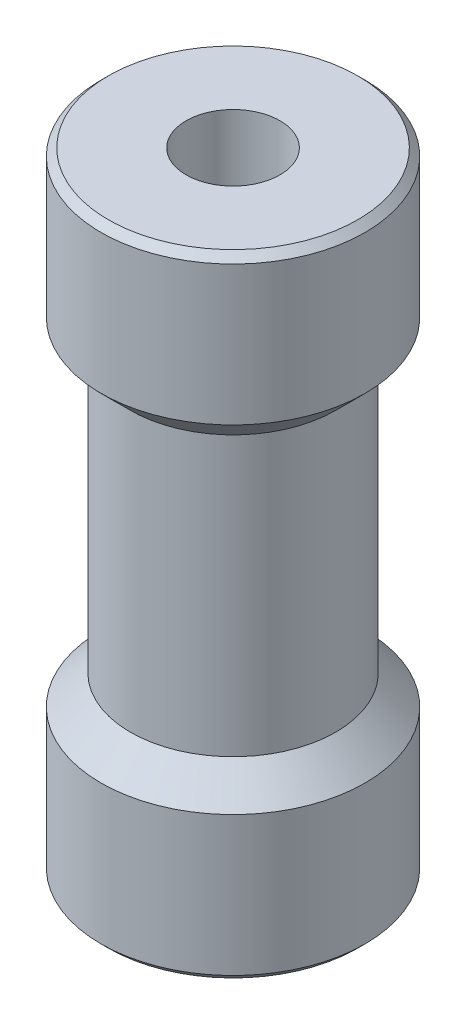
ISO-10303-21;
HEADER;
FILE_DESCRIPTION(('STEP AP214'),'2;1');
FILE_NAME('part.step','',(''),(''),'','','');
FILE_SCHEMA(('AUTOMOTIVE_DESIGN { 1 0 10303 214 1 1 1 1 }'));
ENDSEC;
DATA;
#1=APPLICATION_CONTEXT('core data for automotive mechanical design processes');
#2=APPLICATION_PROTOCOL_DEFINITION('international standard','automotive_design',2000,#1);
#3=PRODUCT_CONTEXT('',#1,'mechanical');
#4=PRODUCT('Part','Part','',(#3));
#5=PRODUCT_RELATED_PRODUCT_CATEGORY('part','',(#4));
#6=PRODUCT_DEFINITION_FORMATION('','',#4);
#7=PRODUCT_DEFINITION_CONTEXT('part definition',#1,'design');
#8=PRODUCT_DEFINITION('design','',#6,#7);
#9=PRODUCT_DEFINITION_SHAPE('','',#8);
#10=(LENGTH_UNIT() NAMED_UNIT(*) SI_UNIT(.MILLI.,.METRE.));
#11=(NAMED_UNIT(*) PLANE_ANGLE_UNIT() SI_UNIT($,.RADIAN.));
#12=(NAMED_UNIT(*) SI_UNIT($,.STERADIAN.) SOLID_ANGLE_UNIT());
#13=UNCERTAINTY_MEASURE_WITH_UNIT(LENGTH_MEASURE(1.E-05),#10,'distance_accuracy_value','');
#14=(GEOMETRIC_REPRESENTATION_CONTEXT(3) GLOBAL_UNCERTAINTY_ASSIGNED_CONTEXT((#13)) GLOBAL_UNIT_ASSIGNED_CONTEXT((#10,
#11,#12)) REPRESENTATION_CONTEXT('',''));
#15=CARTESIAN_POINT('',(0.,0.,0.));
#16=DIRECTION('',(0.,0.,1.));
#17=DIRECTION('',(1.,0.,0.));
#18=AXIS2_PLACEMENT_3D('',#15,#16,#17);
#19=CARTESIAN_POINT('',(0.,0.,0.));
#20=DIRECTION('',(0.,1.,0.));
#21=DIRECTION('',(0.,0.,1.));
#22=AXIS2_PLACEMENT_3D('',#19,#20,#21);
#23=CYLINDRICAL_SURFACE('',#22,3.5);
#24=CARTESIAN_POINT('',(0.,5.99999999997181,0.));
#25=DIRECTION('',(0.,-1.,0.));
#26=DIRECTION('',(1.,0.,0.));
#27=AXIS2_PLACEMENT_3D('',#24,#25,#26);
#28=CIRCLE('',#27,3.49999999991724);
#29=CARTESIAN_POINT('',(3.49999999991724,5.99999999997181,0.));
#30=VERTEX_POINT('',#29);
#31=EDGE_CURVE('E29',#30,#30,#28,.T.);
#32=ORIENTED_EDGE('',*,*,#31,.F.);
#33=EDGE_LOOP('',(#32));
#34=FACE_BOUND('',#33,.T.);
#35=CARTESIAN_POINT('',(0.,15.4999999999745,0.));
#36=DIRECTION('',(0.,1.,0.));
#37=DIRECTION('',(1.,0.,0.));
#38=AXIS2_PLACEMENT_3D('',#35,#36,#37);
#39=CIRCLE('',#38,3.49999999991724);
#40=CARTESIAN_POINT('',(3.49999999991724,15.4999999999745,0.));
#41=VERTEX_POINT('',#40);
#42=EDGE_CURVE('E50',#41,#41,#39,.T.);
#43=ORIENTED_EDGE('',*,*,#42,.F.);
#44=EDGE_LOOP('',(#43));
#45=FACE_BOUND('',#44,.T.);
#46=ADVANCED_FACE('F14',(#34,#45),#23,.T.);
#47=CARTESIAN_POINT('',(0.,4.99999999999545,0.));
#48=DIRECTION('',(0.,-1.,0.));
#49=DIRECTION('',(0.,0.,-1.));
#50=AXIS2_PLACEMENT_3D('',#47,#48,#49);
#51=CONICAL_SURFACE('',#50,4.49999999995043,0.78539816342587);
#52=CARTESIAN_POINT('',(0.,5.,0.));
#53=DIRECTION('',(0.,1.,0.));
#54=DIRECTION('',(0.,0.,1.));
#55=AXIS2_PLACEMENT_3D('',#52,#53,#54);
#56=CIRCLE('',#55,4.5);
#57=CARTESIAN_POINT('',(0.,5.,4.5));
#58=VERTEX_POINT('',#57);
#59=EDGE_CURVE('E48',#58,#58,#56,.F.);
#60=ORIENTED_EDGE('',*,*,#59,.F.);
#61=EDGE_LOOP('',(#60));
#62=FACE_BOUND('',#61,.T.);
#63=ORIENTED_EDGE('',*,*,#31,.T.);
#64=EDGE_LOOP('',(#63));
#65=FACE_BOUND('',#64,.T.);
#66=ADVANCED_FACE('F57',(#62,#65),#51,.T.);
#67=CARTESIAN_POINT('',(0.,16.5000000000646,0.));
#68=DIRECTION('',(0.,1.,0.));
#69=DIRECTION('',(0.,0.,1.));
#70=AXIS2_PLACEMENT_3D('',#67,#68,#69);
#71=CONICAL_SURFACE('',#70,4.50000000000728,0.785398163397448);
#72=CARTESIAN_POINT('',(0.,16.5,0.));
#73=DIRECTION('',(0.,-1.,0.));
#74=DIRECTION('',(0.,0.,-1.));
#75=AXIS2_PLACEMENT_3D('',#72,#73,#74);
#76=CIRCLE('',#75,4.5);
#77=CARTESIAN_POINT('',(0.,16.5,-4.5));
#78=VERTEX_POINT('',#77);
#79=EDGE_CURVE('E44',#78,#78,#76,.F.);
#80=ORIENTED_EDGE('',*,*,#79,.F.);
#81=EDGE_LOOP('',(#80));
#82=FACE_BOUND('',#81,.T.);
#83=ORIENTED_EDGE('',*,*,#42,.T.);
#84=EDGE_LOOP('',(#83));
#85=FACE_BOUND('',#84,.T.);
#86=ADVANCED_FACE('F65',(#82,#85),#71,.T.);
#87=CARTESIAN_POINT('',(0.,0.,0.));
#88=DIRECTION('',(0.,1.,0.));
#89=DIRECTION('',(0.,0.,1.));
#90=AXIS2_PLACEMENT_3D('',#87,#88,#89);
#91=CYLINDRICAL_SURFACE('',#90,4.5);
#92=CARTESIAN_POINT('',(0.,0.250000000050932,0.));
#93=DIRECTION('',(0.,1.,0.));
#94=DIRECTION('',(1.,0.,0.));
#95=AXIS2_PLACEMENT_3D('',#92,#93,#94);
#96=CIRCLE('',#95,4.50000000000728);
#97=CARTESIAN_POINT('',(4.50000000000728,0.250000000050932,0.));
#98=VERTEX_POINT('',#97);
#99=EDGE_CURVE('E39',#98,#98,#96,.F.);
#100=ORIENTED_EDGE('',*,*,#99,.F.);
#101=EDGE_LOOP('',(#100));
#102=FACE_BOUND('',#101,.T.);
#103=ORIENTED_EDGE('',*,*,#59,.T.);
#104=EDGE_LOOP('',(#103));
#105=FACE_BOUND('',#104,.T.);
#106=ADVANCED_FACE('F92',(#102,#105),#91,.T.);
#107=CARTESIAN_POINT('',(0.,21.5,0.));
#108=DIRECTION('',(0.,-1.,0.));
#109=DIRECTION('',(0.,0.,-1.));
#110=AXIS2_PLACEMENT_3D('',#107,#108,#109);
#111=CYLINDRICAL_SURFACE('',#110,4.5);
#112=CARTESIAN_POINT('',(0.,21.2500000000091,0.));
#113=DIRECTION('',(0.,-1.,0.));
#114=DIRECTION('',(1.,0.,0.));
#115=AXIS2_PLACEMENT_3D('',#112,#113,#114);
#116=CIRCLE('',#115,4.49999999995043);
#117=CARTESIAN_POINT('',(4.49999999995043,21.2500000000091,0.));
#118=VERTEX_POINT('',#117);
#119=EDGE_CURVE('E35',#118,#118,#116,.F.);
#120=ORIENTED_EDGE('',*,*,#119,.F.);
#121=EDGE_LOOP('',(#120));
#122=FACE_BOUND('',#121,.T.);
#123=ORIENTED_EDGE('',*,*,#79,.T.);
#124=EDGE_LOOP('',(#123));
#125=FACE_BOUND('',#124,.T.);
#126=ADVANCED_FACE('F89',(#122,#125),#111,.T.);
#127=CARTESIAN_POINT('',(0.,0.250000000050932,0.));
#128=DIRECTION('',(0.,1.,0.));
#129=DIRECTION('',(0.,0.,1.));
#130=AXIS2_PLACEMENT_3D('',#127,#128,#129);
#131=CONICAL_SURFACE('',#130,4.50000000000728,0.785398163397448);
#132=CARTESIAN_POINT('',(0.,5.6843418860808E-11,0.));
#133=DIRECTION('',(0.,1.,0.));
#134=DIRECTION('',(0.,0.,1.));
#135=AXIS2_PLACEMENT_3D('',#132,#133,#134);
#136=CIRCLE('',#135,4.25000000001319);
#137=CARTESIAN_POINT('',(0.,5.6843418860808E-11,4.25000000001319));
#138=VERTEX_POINT('',#137);
#139=EDGE_CURVE('E17',#138,#138,#136,.T.);
#140=ORIENTED_EDGE('',*,*,#139,.T.);
#141=EDGE_LOOP('',(#140));
#142=FACE_BOUND('',#141,.T.);
#143=ORIENTED_EDGE('',*,*,#99,.T.);
#144=EDGE_LOOP('',(#143));
#145=FACE_BOUND('',#144,.T.);
#146=ADVANCED_FACE('F86',(#142,#145),#131,.T.);
#147=CARTESIAN_POINT('',(0.,21.2500000000091,0.));
#148=DIRECTION('',(0.,-1.,0.));
#149=DIRECTION('',(0.,0.,-1.));
#150=AXIS2_PLACEMENT_3D('',#147,#148,#149);
#151=CONICAL_SURFACE('',#150,4.49999999995043,0.785398163397448);
#152=ORIENTED_EDGE('',*,*,#119,.T.);
#153=EDGE_LOOP('',(#152));
#154=FACE_BOUND('',#153,.T.);
#155=CARTESIAN_POINT('',(0.,21.5000000000032,0.));
#156=DIRECTION('',(0.,-1.,0.));
#157=DIRECTION('',(0.,0.,-1.));
#158=AXIS2_PLACEMENT_3D('',#155,#156,#157);
#159=CIRCLE('',#158,4.24999999995634);
#160=CARTESIAN_POINT('',(0.,21.5000000000032,-4.24999999995634));
#161=VERTEX_POINT('',#160);
#162=EDGE_CURVE('E26',#161,#161,#159,.F.);
#163=ORIENTED_EDGE('',*,*,#162,.F.);
#164=EDGE_LOOP('',(#163));
#165=FACE_BOUND('',#164,.T.);
#166=ADVANCED_FACE('F82',(#154,#165),#151,.T.);
#167=CARTESIAN_POINT('',(0.,0.,0.));
#168=DIRECTION('',(0.,1.,0.));
#169=DIRECTION('',(0.,0.,1.));
#170=AXIS2_PLACEMENT_3D('',#167,#168,#169);
#171=PLANE('',#170);
#172=CARTESIAN_POINT('',(0.,0.,0.));
#173=DIRECTION('',(0.,1.,0.));
#174=DIRECTION('',(0.,0.,1.));
#175=AXIS2_PLACEMENT_3D('',#172,#173,#174);
#176=CIRCLE('',#175,1.6);
#177=CARTESIAN_POINT('',(0.,0.,1.6));
#178=VERTEX_POINT('',#177);
#179=EDGE_CURVE('E21',#178,#178,#176,.T.);
#180=ORIENTED_EDGE('',*,*,#179,.T.);
#181=EDGE_LOOP('',(#180));
#182=FACE_BOUND('',#181,.T.);
#183=ORIENTED_EDGE('',*,*,#139,.F.);
#184=EDGE_LOOP('',(#183));
#185=FACE_BOUND('',#184,.T.);
#186=ADVANCED_FACE('F75',(#182,#185),#171,.F.);
#187=CARTESIAN_POINT('',(0.,21.5,0.));
#188=DIRECTION('',(0.,1.,0.));
#189=DIRECTION('',(0.,0.,1.));
#190=AXIS2_PLACEMENT_3D('',#187,#188,#189);
#191=PLANE('',#190);
#192=CARTESIAN_POINT('',(0.,21.5,0.));
#193=DIRECTION('',(0.,1.,0.));
#194=DIRECTION('',(0.,0.,1.));
#195=AXIS2_PLACEMENT_3D('',#192,#193,#194);
#196=CIRCLE('',#195,1.6);
#197=CARTESIAN_POINT('',(0.,21.5,1.6));
#198=VERTEX_POINT('',#197);
#199=EDGE_CURVE('E10',#198,#198,#196,.F.);
#200=ORIENTED_EDGE('',*,*,#199,.T.);
#201=EDGE_LOOP('',(#200));
#202=FACE_BOUND('',#201,.T.);
#203=ORIENTED_EDGE('',*,*,#162,.T.);
#204=EDGE_LOOP('',(#203));
#205=FACE_BOUND('',#204,.T.);
#206=ADVANCED_FACE('F69',(#202,#205),#191,.T.);
#207=CARTESIAN_POINT('',(0.,0.,0.));
#208=DIRECTION('',(0.,1.,0.));
#209=DIRECTION('',(0.,0.,1.));
#210=AXIS2_PLACEMENT_3D('',#207,#208,#209);
#211=CYLINDRICAL_SURFACE('',#210,1.6);
#212=ORIENTED_EDGE('',*,*,#179,.F.);
#213=EDGE_LOOP('',(#212));
#214=FACE_BOUND('',#213,.T.);
#215=ORIENTED_EDGE('',*,*,#199,.F.);
#216=EDGE_LOOP('',(#215));
#217=FACE_BOUND('',#216,.T.);
#218=ADVANCED_FACE('F67',(#214,#217),#211,.F.);
#219=CLOSED_SHELL('',(#46,#66,#86,#106,#126,#146,#166,#186,#206,#218));
#220=MANIFOLD_SOLID_BREP('B1',#219);
#221=ADVANCED_BREP_SHAPE_REPRESENTATION('',(#18,#220),#14);
#222=SHAPE_DEFINITION_REPRESENTATION(#9,#221);
ENDSEC;
END-ISO-10303-21;
